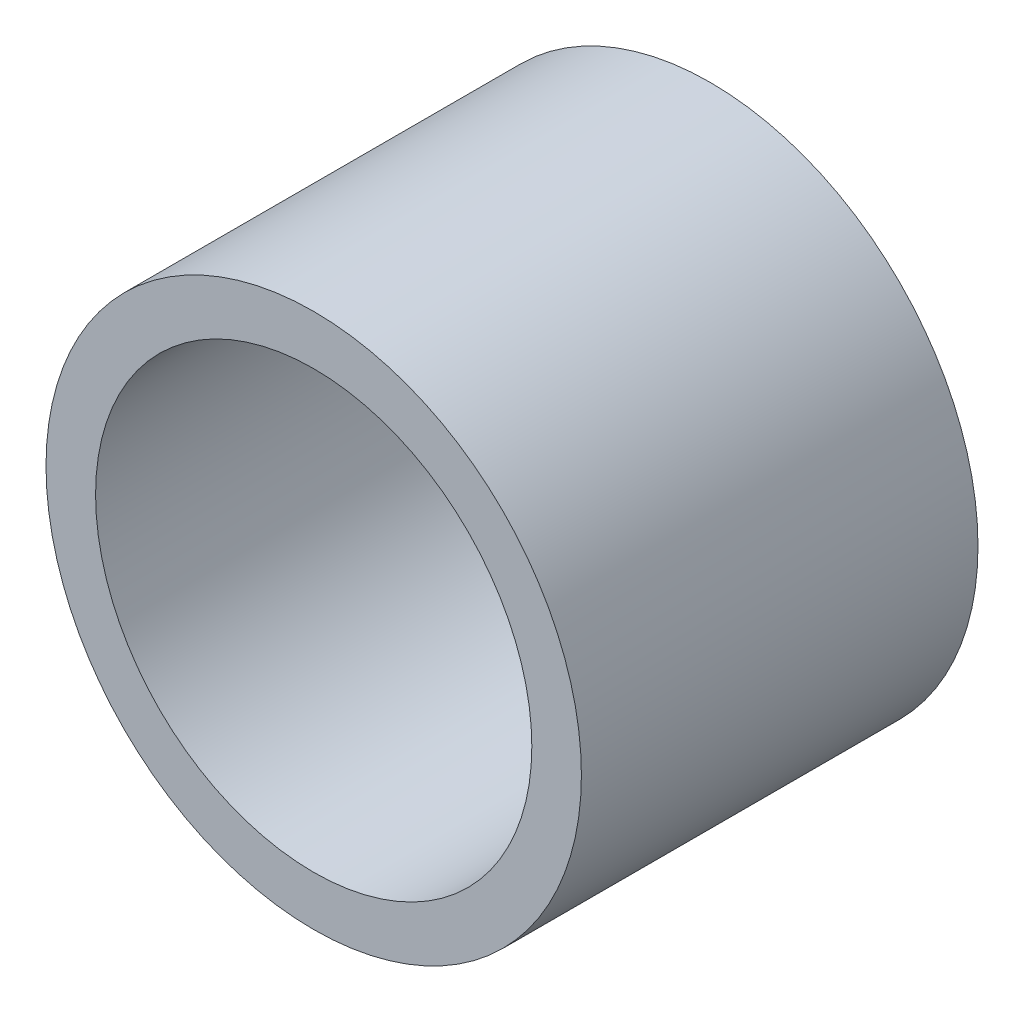
ISO-10303-21;
HEADER;
FILE_DESCRIPTION(('STEP AP214'),'2;1');
FILE_NAME('part.step','',(''),(''),'','','');
FILE_SCHEMA(('AUTOMOTIVE_DESIGN { 1 0 10303 214 1 1 1 1 }'));
ENDSEC;
DATA;
#1=APPLICATION_CONTEXT('core data for automotive mechanical design processes');
#2=APPLICATION_PROTOCOL_DEFINITION('international standard','automotive_design',2000,#1);
#3=PRODUCT_CONTEXT('',#1,'mechanical');
#4=PRODUCT('Part','Part','',(#3));
#5=PRODUCT_RELATED_PRODUCT_CATEGORY('part','',(#4));
#6=PRODUCT_DEFINITION_FORMATION('','',#4);
#7=PRODUCT_DEFINITION_CONTEXT('part definition',#1,'design');
#8=PRODUCT_DEFINITION('design','',#6,#7);
#9=PRODUCT_DEFINITION_SHAPE('','',#8);
#10=(LENGTH_UNIT() NAMED_UNIT(*) SI_UNIT(.MILLI.,.METRE.));
#11=(NAMED_UNIT(*) PLANE_ANGLE_UNIT() SI_UNIT($,.RADIAN.));
#12=(NAMED_UNIT(*) SI_UNIT($,.STERADIAN.) SOLID_ANGLE_UNIT());
#13=UNCERTAINTY_MEASURE_WITH_UNIT(LENGTH_MEASURE(1.E-05),#10,'distance_accuracy_value','');
#14=(GEOMETRIC_REPRESENTATION_CONTEXT(3) GLOBAL_UNCERTAINTY_ASSIGNED_CONTEXT((#13)) GLOBAL_UNIT_ASSIGNED_CONTEXT((#10,
#11,#12)) REPRESENTATION_CONTEXT('',''));
#15=CARTESIAN_POINT('',(0.,0.,0.));
#16=DIRECTION('',(0.,0.,1.));
#17=DIRECTION('',(1.,0.,0.));
#18=AXIS2_PLACEMENT_3D('',#15,#16,#17);
#19=CARTESIAN_POINT('',(0.,0.,10.));
#20=DIRECTION('',(0.,0.,1.));
#21=DIRECTION('',(1.,0.,0.));
#22=AXIS2_PLACEMENT_3D('',#19,#20,#21);
#23=PLANE('',#22);
#24=CARTESIAN_POINT('',(0.,0.,10.));
#25=DIRECTION('',(0.,0.,1.));
#26=DIRECTION('',(1.,0.,0.));
#27=AXIS2_PLACEMENT_3D('',#24,#25,#26);
#28=CIRCLE('',#27,6.75);
#29=CARTESIAN_POINT('',(6.75,0.,10.));
#30=VERTEX_POINT('',#29);
#31=EDGE_CURVE('E10',#30,#30,#28,.T.);
#32=ORIENTED_EDGE('',*,*,#31,.T.);
#33=EDGE_LOOP('',(#32));
#34=FACE_BOUND('',#33,.T.);
#35=CARTESIAN_POINT('',(0.,0.,10.));
#36=DIRECTION('',(0.,0.,1.));
#37=DIRECTION('',(1.,0.,0.));
#38=AXIS2_PLACEMENT_3D('',#35,#36,#37);
#39=CIRCLE('',#38,5.5);
#40=CARTESIAN_POINT('',(5.5,0.,10.));
#41=VERTEX_POINT('',#40);
#42=EDGE_CURVE('E42',#41,#41,#39,.T.);
#43=ORIENTED_EDGE('',*,*,#42,.F.);
#44=EDGE_LOOP('',(#43));
#45=FACE_BOUND('',#44,.T.);
#46=ADVANCED_FACE('F31',(#34,#45),#23,.T.);
#47=CARTESIAN_POINT('',(0.,0.,0.));
#48=DIRECTION('',(0.,0.,1.));
#49=DIRECTION('',(1.,0.,0.));
#50=AXIS2_PLACEMENT_3D('',#47,#48,#49);
#51=PLANE('',#50);
#52=CARTESIAN_POINT('',(0.,0.,0.));
#53=DIRECTION('',(0.,0.,1.));
#54=DIRECTION('',(1.,0.,0.));
#55=AXIS2_PLACEMENT_3D('',#52,#53,#54);
#56=CIRCLE('',#55,6.75);
#57=CARTESIAN_POINT('',(6.75,0.,0.));
#58=VERTEX_POINT('',#57);
#59=EDGE_CURVE('E35',#58,#58,#56,.T.);
#60=ORIENTED_EDGE('',*,*,#59,.F.);
#61=EDGE_LOOP('',(#60));
#62=FACE_BOUND('',#61,.T.);
#63=CARTESIAN_POINT('',(0.,0.,0.));
#64=DIRECTION('',(0.,0.,1.));
#65=DIRECTION('',(1.,0.,0.));
#66=AXIS2_PLACEMENT_3D('',#63,#64,#65);
#67=CIRCLE('',#66,5.5);
#68=CARTESIAN_POINT('',(5.5,0.,0.));
#69=VERTEX_POINT('',#68);
#70=EDGE_CURVE('E44',#69,#69,#67,.T.);
#71=ORIENTED_EDGE('',*,*,#70,.T.);
#72=EDGE_LOOP('',(#71));
#73=FACE_BOUND('',#72,.T.);
#74=ADVANCED_FACE('F54',(#62,#73),#51,.F.);
#75=CARTESIAN_POINT('',(0.,0.,10.));
#76=DIRECTION('',(0.,0.,-1.));
#77=DIRECTION('',(-1.,0.,0.));
#78=AXIS2_PLACEMENT_3D('',#75,#76,#77);
#79=CYLINDRICAL_SURFACE('',#78,6.75);
#80=ORIENTED_EDGE('',*,*,#31,.F.);
#81=EDGE_LOOP('',(#80));
#82=FACE_BOUND('',#81,.T.);
#83=ORIENTED_EDGE('',*,*,#59,.T.);
#84=EDGE_LOOP('',(#83));
#85=FACE_BOUND('',#84,.T.);
#86=ADVANCED_FACE('F33',(#82,#85),#79,.T.);
#87=CARTESIAN_POINT('',(0.,0.,10.));
#88=DIRECTION('',(0.,0.,-1.));
#89=DIRECTION('',(-1.,0.,0.));
#90=AXIS2_PLACEMENT_3D('',#87,#88,#89);
#91=CYLINDRICAL_SURFACE('',#90,5.5);
#92=ORIENTED_EDGE('',*,*,#42,.T.);
#93=EDGE_LOOP('',(#92));
#94=FACE_BOUND('',#93,.T.);
#95=ORIENTED_EDGE('',*,*,#70,.F.);
#96=EDGE_LOOP('',(#95));
#97=FACE_BOUND('',#96,.T.);
#98=ADVANCED_FACE('F50',(#94,#97),#91,.F.);
#99=CLOSED_SHELL('',(#46,#74,#86,#98));
#100=MANIFOLD_SOLID_BREP('B2',#99);
#101=ADVANCED_BREP_SHAPE_REPRESENTATION('',(#18,#100),#14);
#102=SHAPE_DEFINITION_REPRESENTATION(#9,#101);
ENDSEC;
END-ISO-10303-21;
